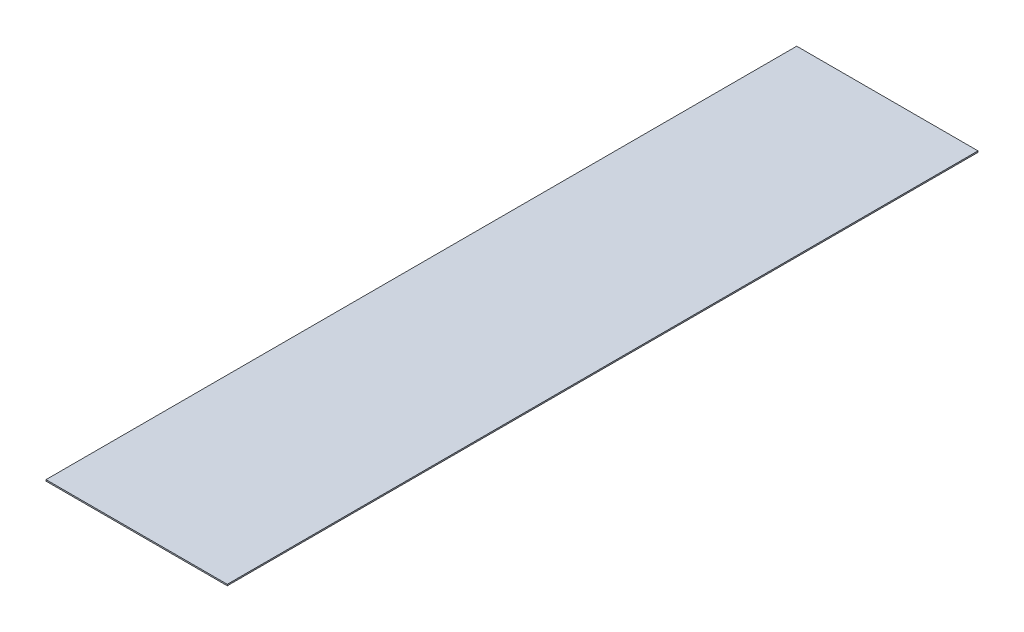
ISO-10303-21;
HEADER;
FILE_DESCRIPTION(('STEP AP214'),'2;1');
FILE_NAME('part.step','',(''),(''),'','','');
FILE_SCHEMA(('AUTOMOTIVE_DESIGN { 1 0 10303 214 1 1 1 1 }'));
ENDSEC;
DATA;
#1=APPLICATION_CONTEXT('core data for automotive mechanical design processes');
#2=APPLICATION_PROTOCOL_DEFINITION('international standard','automotive_design',2000,#1);
#3=PRODUCT_CONTEXT('',#1,'mechanical');
#4=PRODUCT('Part','Part','',(#3));
#5=PRODUCT_RELATED_PRODUCT_CATEGORY('part','',(#4));
#6=PRODUCT_DEFINITION_FORMATION('','',#4);
#7=PRODUCT_DEFINITION_CONTEXT('part definition',#1,'design');
#8=PRODUCT_DEFINITION('design','',#6,#7);
#9=PRODUCT_DEFINITION_SHAPE('','',#8);
#10=(LENGTH_UNIT() NAMED_UNIT(*) SI_UNIT(.MILLI.,.METRE.));
#11=(NAMED_UNIT(*) PLANE_ANGLE_UNIT() SI_UNIT($,.RADIAN.));
#12=(NAMED_UNIT(*) SI_UNIT($,.STERADIAN.) SOLID_ANGLE_UNIT());
#13=UNCERTAINTY_MEASURE_WITH_UNIT(LENGTH_MEASURE(1.E-05),#10,'distance_accuracy_value','');
#14=(GEOMETRIC_REPRESENTATION_CONTEXT(3) GLOBAL_UNCERTAINTY_ASSIGNED_CONTEXT((#13)) GLOBAL_UNIT_ASSIGNED_CONTEXT((#10,
#11,#12)) REPRESENTATION_CONTEXT('',''));
#15=CARTESIAN_POINT('',(0.,0.,0.));
#16=DIRECTION('',(0.,0.,1.));
#17=DIRECTION('',(1.,0.,0.));
#18=AXIS2_PLACEMENT_3D('',#15,#16,#17);
#19=CARTESIAN_POINT('',(3569.89932060242,-3.175,894.08));
#20=DIRECTION('',(-1.,0.,0.));
#21=DIRECTION('',(0.,0.,1.));
#22=AXIS2_PLACEMENT_3D('',#19,#20,#21);
#23=PLANE('',#22);
#24=DIRECTION('',(0.,0.,1.));
#25=VECTOR('',#24,1.);
#26=CARTESIAN_POINT('',(3569.89932060242,0.,894.08));
#27=LINE('',#26,#25);
#28=CARTESIAN_POINT('',(3569.89932060242,0.,0.));
#29=VERTEX_POINT('',#28);
#30=CARTESIAN_POINT('',(3569.89932060242,0.,1788.16));
#31=VERTEX_POINT('',#30);
#32=EDGE_CURVE('E99',#29,#31,#27,.T.);
#33=ORIENTED_EDGE('',*,*,#32,.F.);
#34=DIRECTION('',(0.,1.,0.));
#35=VECTOR('',#34,1.);
#36=CARTESIAN_POINT('',(3569.89932060242,-3.175,0.));
#37=LINE('',#36,#35);
#38=CARTESIAN_POINT('',(3569.89932060242,-3.175,0.));
#39=VERTEX_POINT('',#38);
#40=EDGE_CURVE('E9',#39,#29,#37,.T.);
#41=ORIENTED_EDGE('',*,*,#40,.F.);
#42=DIRECTION('',(0.,0.,1.));
#43=VECTOR('',#42,1.);
#44=CARTESIAN_POINT('',(3569.89932060242,-3.175,894.08));
#45=LINE('',#44,#43);
#46=CARTESIAN_POINT('',(3569.89932060242,-3.175,1788.16));
#47=VERTEX_POINT('',#46);
#48=EDGE_CURVE('E77',#39,#47,#45,.T.);
#49=ORIENTED_EDGE('',*,*,#48,.T.);
#50=DIRECTION('',(0.,1.,0.));
#51=VECTOR('',#50,1.);
#52=CARTESIAN_POINT('',(3569.89932060242,-3.175,1788.16));
#53=LINE('',#52,#51);
#54=EDGE_CURVE('E36',#47,#31,#53,.T.);
#55=ORIENTED_EDGE('',*,*,#54,.T.);
#56=EDGE_LOOP('',(#33,#41,#49,#55));
#57=FACE_BOUND('',#56,.T.);
#58=ADVANCED_FACE('F14',(#57),#23,.T.);
#59=CARTESIAN_POINT('',(3785.79932060242,-3.175,0.));
#60=DIRECTION('',(0.,0.,1.));
#61=DIRECTION('',(1.,0.,0.));
#62=AXIS2_PLACEMENT_3D('',#59,#60,#61);
#63=PLANE('',#62);
#64=DIRECTION('',(1.,0.,0.));
#65=VECTOR('',#64,1.);
#66=CARTESIAN_POINT('',(3785.79932060242,0.,0.));
#67=LINE('',#66,#65);
#68=CARTESIAN_POINT('',(4001.69932060242,0.,0.));
#69=VERTEX_POINT('',#68);
#70=EDGE_CURVE('E84',#29,#69,#67,.T.);
#71=ORIENTED_EDGE('',*,*,#70,.T.);
#72=DIRECTION('',(0.,1.,0.));
#73=VECTOR('',#72,1.);
#74=CARTESIAN_POINT('',(4001.69932060242,-3.175,0.));
#75=LINE('',#74,#73);
#76=CARTESIAN_POINT('',(4001.69932060242,-3.175,0.));
#77=VERTEX_POINT('',#76);
#78=EDGE_CURVE('E23',#77,#69,#75,.T.);
#79=ORIENTED_EDGE('',*,*,#78,.F.);
#80=DIRECTION('',(1.,0.,0.));
#81=VECTOR('',#80,1.);
#82=CARTESIAN_POINT('',(3785.79932060242,-3.175,0.));
#83=LINE('',#82,#81);
#84=EDGE_CURVE('E71',#39,#77,#83,.T.);
#85=ORIENTED_EDGE('',*,*,#84,.F.);
#86=ORIENTED_EDGE('',*,*,#40,.T.);
#87=EDGE_LOOP('',(#71,#79,#85,#86));
#88=FACE_BOUND('',#87,.T.);
#89=ADVANCED_FACE('F82',(#88),#63,.F.);
#90=CARTESIAN_POINT('',(4001.69932060242,-3.175,894.08));
#91=DIRECTION('',(-1.,0.,0.));
#92=DIRECTION('',(0.,0.,1.));
#93=AXIS2_PLACEMENT_3D('',#90,#91,#92);
#94=PLANE('',#93);
#95=DIRECTION('',(0.,0.,1.));
#96=VECTOR('',#95,1.);
#97=CARTESIAN_POINT('',(4001.69932060242,0.,894.08));
#98=LINE('',#97,#96);
#99=CARTESIAN_POINT('',(4001.69932060242,0.,1788.16));
#100=VERTEX_POINT('',#99);
#101=EDGE_CURVE('E104',#69,#100,#98,.T.);
#102=ORIENTED_EDGE('',*,*,#101,.T.);
#103=DIRECTION('',(0.,1.,0.));
#104=VECTOR('',#103,1.);
#105=CARTESIAN_POINT('',(4001.69932060242,-3.175,1788.16));
#106=LINE('',#105,#104);
#107=CARTESIAN_POINT('',(4001.69932060242,-3.175,1788.16));
#108=VERTEX_POINT('',#107);
#109=EDGE_CURVE('E54',#108,#100,#106,.T.);
#110=ORIENTED_EDGE('',*,*,#109,.F.);
#111=DIRECTION('',(0.,0.,1.));
#112=VECTOR('',#111,1.);
#113=CARTESIAN_POINT('',(4001.69932060242,-3.175,894.08));
#114=LINE('',#113,#112);
#115=EDGE_CURVE('E76',#77,#108,#114,.T.);
#116=ORIENTED_EDGE('',*,*,#115,.F.);
#117=ORIENTED_EDGE('',*,*,#78,.T.);
#118=EDGE_LOOP('',(#102,#110,#116,#117));
#119=FACE_BOUND('',#118,.T.);
#120=ADVANCED_FACE('F88',(#119),#94,.F.);
#121=CARTESIAN_POINT('',(3785.79932060242,-3.175,1788.16));
#122=DIRECTION('',(0.,0.,1.));
#123=DIRECTION('',(1.,0.,0.));
#124=AXIS2_PLACEMENT_3D('',#121,#122,#123);
#125=PLANE('',#124);
#126=DIRECTION('',(1.,0.,0.));
#127=VECTOR('',#126,1.);
#128=CARTESIAN_POINT('',(3785.79932060242,0.,1788.16));
#129=LINE('',#128,#127);
#130=EDGE_CURVE('E106',#31,#100,#129,.T.);
#131=ORIENTED_EDGE('',*,*,#130,.F.);
#132=ORIENTED_EDGE('',*,*,#54,.F.);
#133=DIRECTION('',(1.,0.,0.));
#134=VECTOR('',#133,1.);
#135=CARTESIAN_POINT('',(3785.79932060242,-3.175,1788.16));
#136=LINE('',#135,#134);
#137=EDGE_CURVE('E90',#47,#108,#136,.T.);
#138=ORIENTED_EDGE('',*,*,#137,.T.);
#139=ORIENTED_EDGE('',*,*,#109,.T.);
#140=EDGE_LOOP('',(#131,#132,#138,#139));
#141=FACE_BOUND('',#140,.T.);
#142=ADVANCED_FACE('F125',(#141),#125,.T.);
#143=CARTESIAN_POINT('',(3785.79932060242,-3.175,894.08));
#144=DIRECTION('',(0.,-1.,0.));
#145=DIRECTION('',(1.,0.,0.));
#146=AXIS2_PLACEMENT_3D('',#143,#144,#145);
#147=PLANE('',#146);
#148=ORIENTED_EDGE('',*,*,#48,.F.);
#149=ORIENTED_EDGE('',*,*,#84,.T.);
#150=ORIENTED_EDGE('',*,*,#115,.T.);
#151=ORIENTED_EDGE('',*,*,#137,.F.);
#152=EDGE_LOOP('',(#148,#149,#150,#151));
#153=FACE_BOUND('',#152,.T.);
#154=ADVANCED_FACE('F73',(#153),#147,.T.);
#155=CARTESIAN_POINT('',(3785.79932060242,0.,894.08));
#156=DIRECTION('',(0.,-1.,0.));
#157=DIRECTION('',(1.,0.,0.));
#158=AXIS2_PLACEMENT_3D('',#155,#156,#157);
#159=PLANE('',#158);
#160=ORIENTED_EDGE('',*,*,#32,.T.);
#161=ORIENTED_EDGE('',*,*,#130,.T.);
#162=ORIENTED_EDGE('',*,*,#101,.F.);
#163=ORIENTED_EDGE('',*,*,#70,.F.);
#164=EDGE_LOOP('',(#160,#161,#162,#163));
#165=FACE_BOUND('',#164,.T.);
#166=ADVANCED_FACE('F133',(#165),#159,.F.);
#167=CLOSED_SHELL('',(#58,#89,#120,#142,#154,#166));
#168=MANIFOLD_SOLID_BREP('B1',#167);
#169=ADVANCED_BREP_SHAPE_REPRESENTATION('',(#18,#168),#14);
#170=SHAPE_DEFINITION_REPRESENTATION(#9,#169);
ENDSEC;
END-ISO-10303-21;
